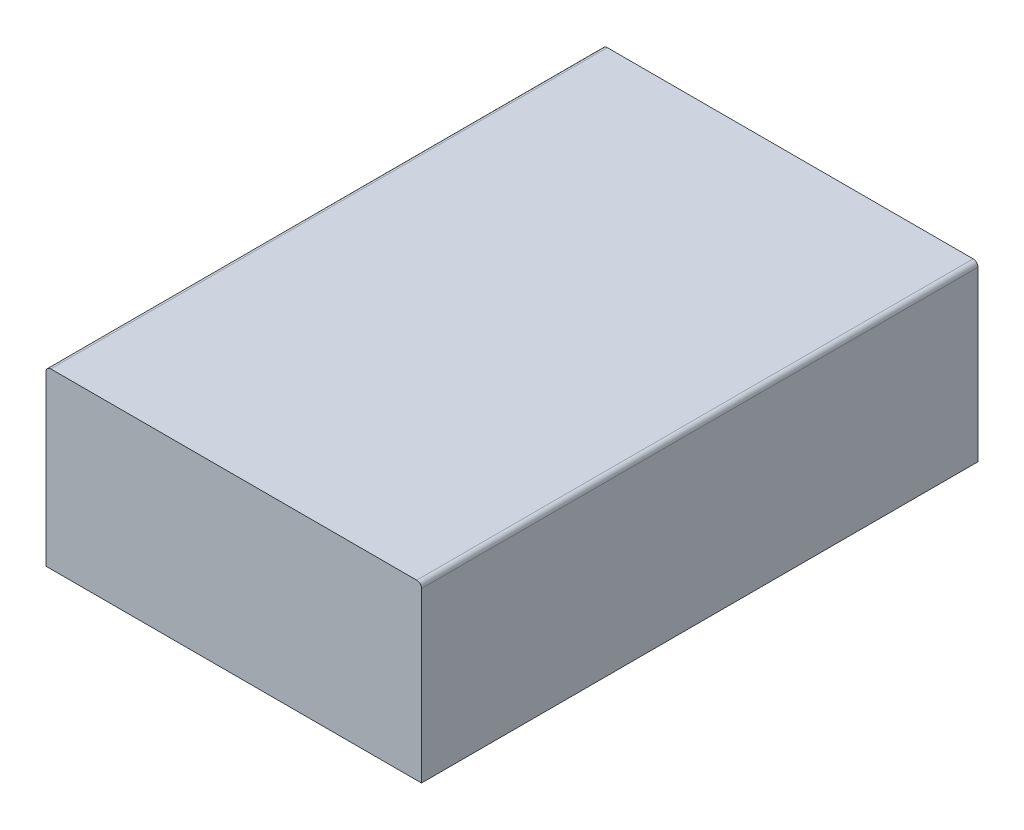
ISO-10303-21;
HEADER;
FILE_DESCRIPTION(('STEP AP214'),'2;1');
FILE_NAME('part.step','',(''),(''),'','','');
FILE_SCHEMA(('AUTOMOTIVE_DESIGN { 1 0 10303 214 1 1 1 1 }'));
ENDSEC;
DATA;
#1=APPLICATION_CONTEXT('core data for automotive mechanical design processes');
#2=APPLICATION_PROTOCOL_DEFINITION('international standard','automotive_design',2000,#1);
#3=PRODUCT_CONTEXT('',#1,'mechanical');
#4=PRODUCT('Part','Part','',(#3));
#5=PRODUCT_RELATED_PRODUCT_CATEGORY('part','',(#4));
#6=PRODUCT_DEFINITION_FORMATION('','',#4);
#7=PRODUCT_DEFINITION_CONTEXT('part definition',#1,'design');
#8=PRODUCT_DEFINITION('design','',#6,#7);
#9=PRODUCT_DEFINITION_SHAPE('','',#8);
#10=(LENGTH_UNIT() NAMED_UNIT(*) SI_UNIT(.MILLI.,.METRE.));
#11=(NAMED_UNIT(*) PLANE_ANGLE_UNIT() SI_UNIT($,.RADIAN.));
#12=(NAMED_UNIT(*) SI_UNIT($,.STERADIAN.) SOLID_ANGLE_UNIT());
#13=UNCERTAINTY_MEASURE_WITH_UNIT(LENGTH_MEASURE(1.E-05),#10,'distance_accuracy_value','');
#14=(GEOMETRIC_REPRESENTATION_CONTEXT(3) GLOBAL_UNCERTAINTY_ASSIGNED_CONTEXT((#13)) GLOBAL_UNIT_ASSIGNED_CONTEXT((#10,
#11,#12)) REPRESENTATION_CONTEXT('',''));
#15=CARTESIAN_POINT('',(0.,0.,0.));
#16=DIRECTION('',(0.,0.,1.));
#17=DIRECTION('',(1.,0.,0.));
#18=AXIS2_PLACEMENT_3D('',#15,#16,#17);
#19=CARTESIAN_POINT('',(19.5,18.,28.9));
#20=DIRECTION('',(-1.,0.,0.));
#21=DIRECTION('',(0.,0.,1.));
#22=AXIS2_PLACEMENT_3D('',#19,#20,#21);
#23=PLANE('',#22);
#24=DIRECTION('',(0.,-1.,0.));
#25=VECTOR('',#24,1.);
#26=CARTESIAN_POINT('',(19.5,18.,-28.9));
#27=LINE('',#26,#25);
#28=CARTESIAN_POINT('',(19.5,17.5,-28.9));
#29=VERTEX_POINT('',#28);
#30=CARTESIAN_POINT('',(19.5,0.,-28.9));
#31=VERTEX_POINT('',#30);
#32=EDGE_CURVE('E96',#29,#31,#27,.T.);
#33=ORIENTED_EDGE('',*,*,#32,.F.);
#34=DIRECTION('',(0.,0.,-1.));
#35=VECTOR('',#34,1.);
#36=CARTESIAN_POINT('',(19.5,17.5,28.9));
#37=LINE('',#36,#35);
#38=CARTESIAN_POINT('',(19.5,17.5,28.9));
#39=VERTEX_POINT('',#38);
#40=EDGE_CURVE('E11',#29,#39,#37,.F.);
#41=ORIENTED_EDGE('',*,*,#40,.T.);
#42=DIRECTION('',(0.,-1.,0.));
#43=VECTOR('',#42,1.);
#44=CARTESIAN_POINT('',(19.5,18.,28.9));
#45=LINE('',#44,#43);
#46=CARTESIAN_POINT('',(19.5,0.,28.9));
#47=VERTEX_POINT('',#46);
#48=EDGE_CURVE('E118',#39,#47,#45,.T.);
#49=ORIENTED_EDGE('',*,*,#48,.T.);
#50=DIRECTION('',(0.,0.,-1.));
#51=VECTOR('',#50,1.);
#52=CARTESIAN_POINT('',(19.5,0.,28.9));
#53=LINE('',#52,#51);
#54=EDGE_CURVE('E112',#47,#31,#53,.T.);
#55=ORIENTED_EDGE('',*,*,#54,.T.);
#56=EDGE_LOOP('',(#33,#41,#49,#55));
#57=FACE_BOUND('',#56,.T.);
#58=ADVANCED_FACE('F44',(#57),#23,.F.);
#59=CARTESIAN_POINT('',(-19.5,18.,-28.9));
#60=DIRECTION('',(0.,0.,1.));
#61=DIRECTION('',(1.,0.,0.));
#62=AXIS2_PLACEMENT_3D('',#59,#60,#61);
#63=PLANE('',#62);
#64=DIRECTION('',(0.,-1.,0.));
#65=VECTOR('',#64,1.);
#66=CARTESIAN_POINT('',(-19.5,18.,-28.9));
#67=LINE('',#66,#65);
#68=CARTESIAN_POINT('',(-19.5,17.5,-28.9));
#69=VERTEX_POINT('',#68);
#70=CARTESIAN_POINT('',(-19.5,0.,-28.9));
#71=VERTEX_POINT('',#70);
#72=EDGE_CURVE('E106',#69,#71,#67,.T.);
#73=ORIENTED_EDGE('',*,*,#72,.F.);
#74=CARTESIAN_POINT('',(-19.,17.5,-28.9));
#75=DIRECTION('',(0.,0.,1.));
#76=DIRECTION('',(1.,0.,0.));
#77=AXIS2_PLACEMENT_3D('',#74,#75,#76);
#78=CIRCLE('',#77,0.5);
#79=CARTESIAN_POINT('',(-19.,18.,-28.9));
#80=VERTEX_POINT('',#79);
#81=EDGE_CURVE('E53',#69,#80,#78,.F.);
#82=ORIENTED_EDGE('',*,*,#81,.T.);
#83=DIRECTION('',(-1.,0.,0.));
#84=VECTOR('',#83,1.);
#85=CARTESIAN_POINT('',(-19.5,18.,-28.9));
#86=LINE('',#85,#84);
#87=CARTESIAN_POINT('',(19.,18.,-28.9));
#88=VERTEX_POINT('',#87);
#89=EDGE_CURVE('E131',#88,#80,#86,.T.);
#90=ORIENTED_EDGE('',*,*,#89,.F.);
#91=CARTESIAN_POINT('',(19.,17.5,-28.9));
#92=DIRECTION('',(0.,0.,1.));
#93=DIRECTION('',(1.,0.,0.));
#94=AXIS2_PLACEMENT_3D('',#91,#92,#93);
#95=CIRCLE('',#94,0.5);
#96=EDGE_CURVE('E60',#88,#29,#95,.F.);
#97=ORIENTED_EDGE('',*,*,#96,.T.);
#98=ORIENTED_EDGE('',*,*,#32,.T.);
#99=DIRECTION('',(-1.,0.,0.));
#100=VECTOR('',#99,1.);
#101=CARTESIAN_POINT('',(-19.5,0.,-28.9));
#102=LINE('',#101,#100);
#103=EDGE_CURVE('E99',#31,#71,#102,.T.);
#104=ORIENTED_EDGE('',*,*,#103,.T.);
#105=EDGE_LOOP('',(#73,#82,#90,#97,#98,#104));
#106=FACE_BOUND('',#105,.T.);
#107=ADVANCED_FACE('F98',(#106),#63,.F.);
#108=CARTESIAN_POINT('',(-19.5,18.,28.9));
#109=DIRECTION('',(1.,0.,0.));
#110=DIRECTION('',(0.,0.,-1.));
#111=AXIS2_PLACEMENT_3D('',#108,#109,#110);
#112=PLANE('',#111);
#113=DIRECTION('',(0.,-1.,0.));
#114=VECTOR('',#113,1.);
#115=CARTESIAN_POINT('',(-19.5,18.,28.9));
#116=LINE('',#115,#114);
#117=CARTESIAN_POINT('',(-19.5,17.5,28.9));
#118=VERTEX_POINT('',#117);
#119=CARTESIAN_POINT('',(-19.5,0.,28.9));
#120=VERTEX_POINT('',#119);
#121=EDGE_CURVE('E134',#118,#120,#116,.T.);
#122=ORIENTED_EDGE('',*,*,#121,.F.);
#123=DIRECTION('',(0.,0.,1.));
#124=VECTOR('',#123,1.);
#125=CARTESIAN_POINT('',(-19.5,17.5,28.9));
#126=LINE('',#125,#124);
#127=EDGE_CURVE('E68',#118,#69,#126,.F.);
#128=ORIENTED_EDGE('',*,*,#127,.T.);
#129=ORIENTED_EDGE('',*,*,#72,.T.);
#130=DIRECTION('',(0.,0.,1.));
#131=VECTOR('',#130,1.);
#132=CARTESIAN_POINT('',(-19.5,0.,28.9));
#133=LINE('',#132,#131);
#134=EDGE_CURVE('E114',#71,#120,#133,.T.);
#135=ORIENTED_EDGE('',*,*,#134,.T.);
#136=EDGE_LOOP('',(#122,#128,#129,#135));
#137=FACE_BOUND('',#136,.T.);
#138=ADVANCED_FACE('F169',(#137),#112,.F.);
#139=CARTESIAN_POINT('',(-19.5,18.,28.9));
#140=DIRECTION('',(0.,0.,-1.));
#141=DIRECTION('',(-1.,0.,0.));
#142=AXIS2_PLACEMENT_3D('',#139,#140,#141);
#143=PLANE('',#142);
#144=DIRECTION('',(1.,0.,0.));
#145=VECTOR('',#144,1.);
#146=CARTESIAN_POINT('',(-19.5,18.,28.9));
#147=LINE('',#146,#145);
#148=CARTESIAN_POINT('',(-19.,18.,28.9));
#149=VERTEX_POINT('',#148);
#150=CARTESIAN_POINT('',(19.,18.,28.9));
#151=VERTEX_POINT('',#150);
#152=EDGE_CURVE('E123',#149,#151,#147,.T.);
#153=ORIENTED_EDGE('',*,*,#152,.F.);
#154=CARTESIAN_POINT('',(-19.,17.5,28.9));
#155=DIRECTION('',(0.,0.,-1.));
#156=DIRECTION('',(-1.,0.,0.));
#157=AXIS2_PLACEMENT_3D('',#154,#155,#156);
#158=CIRCLE('',#157,0.5);
#159=EDGE_CURVE('E149',#149,#118,#158,.F.);
#160=ORIENTED_EDGE('',*,*,#159,.T.);
#161=ORIENTED_EDGE('',*,*,#121,.T.);
#162=DIRECTION('',(1.,0.,0.));
#163=VECTOR('',#162,1.);
#164=CARTESIAN_POINT('',(-19.5,0.,28.9));
#165=LINE('',#164,#163);
#166=EDGE_CURVE('E128',#120,#47,#165,.T.);
#167=ORIENTED_EDGE('',*,*,#166,.T.);
#168=ORIENTED_EDGE('',*,*,#48,.F.);
#169=CARTESIAN_POINT('',(19.,17.5,28.9));
#170=DIRECTION('',(0.,0.,-1.));
#171=DIRECTION('',(-1.,0.,0.));
#172=AXIS2_PLACEMENT_3D('',#169,#170,#171);
#173=CIRCLE('',#172,0.5);
#174=EDGE_CURVE('E146',#39,#151,#173,.F.);
#175=ORIENTED_EDGE('',*,*,#174,.T.);
#176=EDGE_LOOP('',(#153,#160,#161,#167,#168,#175));
#177=FACE_BOUND('',#176,.T.);
#178=ADVANCED_FACE('F168',(#177),#143,.F.);
#179=CARTESIAN_POINT('',(0.,18.,0.));
#180=DIRECTION('',(0.,-1.,0.));
#181=DIRECTION('',(0.,0.,-1.));
#182=AXIS2_PLACEMENT_3D('',#179,#180,#181);
#183=PLANE('',#182);
#184=ORIENTED_EDGE('',*,*,#89,.T.);
#185=DIRECTION('',(0.,0.,1.));
#186=VECTOR('',#185,1.);
#187=CARTESIAN_POINT('',(-19.,18.,0.));
#188=LINE('',#187,#186);
#189=EDGE_CURVE('E142',#80,#149,#188,.T.);
#190=ORIENTED_EDGE('',*,*,#189,.T.);
#191=ORIENTED_EDGE('',*,*,#152,.T.);
#192=DIRECTION('',(0.,0.,-1.));
#193=VECTOR('',#192,1.);
#194=CARTESIAN_POINT('',(19.,18.,0.));
#195=LINE('',#194,#193);
#196=EDGE_CURVE('E105',#151,#88,#195,.T.);
#197=ORIENTED_EDGE('',*,*,#196,.T.);
#198=EDGE_LOOP('',(#184,#190,#191,#197));
#199=FACE_BOUND('',#198,.T.);
#200=ADVANCED_FACE('F161',(#199),#183,.F.);
#201=CARTESIAN_POINT('',(0.,0.,0.));
#202=DIRECTION('',(0.,-1.,0.));
#203=DIRECTION('',(0.,0.,-1.));
#204=AXIS2_PLACEMENT_3D('',#201,#202,#203);
#205=PLANE('',#204);
#206=ORIENTED_EDGE('',*,*,#54,.F.);
#207=ORIENTED_EDGE('',*,*,#166,.F.);
#208=ORIENTED_EDGE('',*,*,#134,.F.);
#209=ORIENTED_EDGE('',*,*,#103,.F.);
#210=EDGE_LOOP('',(#206,#207,#208,#209));
#211=FACE_BOUND('',#210,.T.);
#212=ADVANCED_FACE('F110',(#211),#205,.T.);
#213=CARTESIAN_POINT('',(-19.,17.5,0.));
#214=DIRECTION('',(0.,0.,1.));
#215=DIRECTION('',(1.,0.,0.));
#216=AXIS2_PLACEMENT_3D('',#213,#214,#215);
#217=CYLINDRICAL_SURFACE('',#216,0.5);
#218=ORIENTED_EDGE('',*,*,#81,.F.);
#219=ORIENTED_EDGE('',*,*,#127,.F.);
#220=ORIENTED_EDGE('',*,*,#159,.F.);
#221=ORIENTED_EDGE('',*,*,#189,.F.);
#222=EDGE_LOOP('',(#218,#219,#220,#221));
#223=FACE_BOUND('',#222,.T.);
#224=ADVANCED_FACE('F166',(#223),#217,.T.);
#225=CARTESIAN_POINT('',(19.,17.5,0.));
#226=DIRECTION('',(0.,0.,-1.));
#227=DIRECTION('',(-1.,0.,0.));
#228=AXIS2_PLACEMENT_3D('',#225,#226,#227);
#229=CYLINDRICAL_SURFACE('',#228,0.5);
#230=ORIENTED_EDGE('',*,*,#174,.F.);
#231=ORIENTED_EDGE('',*,*,#40,.F.);
#232=ORIENTED_EDGE('',*,*,#96,.F.);
#233=ORIENTED_EDGE('',*,*,#196,.F.);
#234=EDGE_LOOP('',(#230,#231,#232,#233));
#235=FACE_BOUND('',#234,.T.);
#236=ADVANCED_FACE('F46',(#235),#229,.T.);
#237=CLOSED_SHELL('',(#58,#107,#138,#178,#200,#212,#224,#236));
#238=MANIFOLD_SOLID_BREP('B2',#237);
#239=ADVANCED_BREP_SHAPE_REPRESENTATION('',(#18,#238),#14);
#240=SHAPE_DEFINITION_REPRESENTATION(#9,#239);
ENDSEC;
END-ISO-10303-21;
